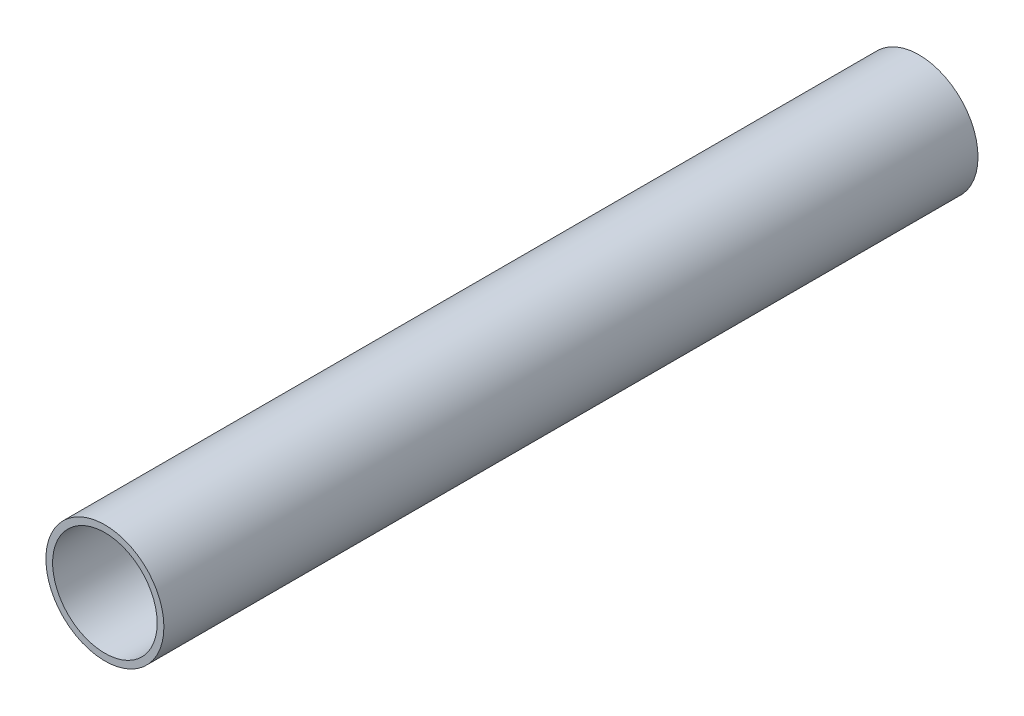
ISO-10303-21;
HEADER;
FILE_DESCRIPTION(('STEP AP214'),'2;1');
FILE_NAME('part.step','',(''),(''),'','','');
FILE_SCHEMA(('AUTOMOTIVE_DESIGN { 1 0 10303 214 1 1 1 1 }'));
ENDSEC;
DATA;
#1=APPLICATION_CONTEXT('core data for automotive mechanical design processes');
#2=APPLICATION_PROTOCOL_DEFINITION('international standard','automotive_design',2000,#1);
#3=PRODUCT_CONTEXT('',#1,'mechanical');
#4=PRODUCT('Part','Part','',(#3));
#5=PRODUCT_RELATED_PRODUCT_CATEGORY('part','',(#4));
#6=PRODUCT_DEFINITION_FORMATION('','',#4);
#7=PRODUCT_DEFINITION_CONTEXT('part definition',#1,'design');
#8=PRODUCT_DEFINITION('design','',#6,#7);
#9=PRODUCT_DEFINITION_SHAPE('','',#8);
#10=(LENGTH_UNIT() NAMED_UNIT(*) SI_UNIT(.MILLI.,.METRE.));
#11=(NAMED_UNIT(*) PLANE_ANGLE_UNIT() SI_UNIT($,.RADIAN.));
#12=(NAMED_UNIT(*) SI_UNIT($,.STERADIAN.) SOLID_ANGLE_UNIT());
#13=UNCERTAINTY_MEASURE_WITH_UNIT(LENGTH_MEASURE(1.E-05),#10,'distance_accuracy_value','');
#14=(GEOMETRIC_REPRESENTATION_CONTEXT(3) GLOBAL_UNCERTAINTY_ASSIGNED_CONTEXT((#13)) GLOBAL_UNIT_ASSIGNED_CONTEXT((#10,
#11,#12)) REPRESENTATION_CONTEXT('',''));
#15=CARTESIAN_POINT('',(0.,0.,0.));
#16=DIRECTION('',(0.,0.,1.));
#17=DIRECTION('',(1.,0.,0.));
#18=AXIS2_PLACEMENT_3D('',#15,#16,#17);
#19=CARTESIAN_POINT('',(0.,0.,242.));
#20=DIRECTION('',(0.,0.,1.));
#21=DIRECTION('',(1.,0.,0.));
#22=AXIS2_PLACEMENT_3D('',#19,#20,#21);
#23=PLANE('',#22);
#24=CARTESIAN_POINT('',(0.,0.,242.));
#25=DIRECTION('',(0.,0.,1.));
#26=DIRECTION('',(1.,0.,0.));
#27=AXIS2_PLACEMENT_3D('',#24,#25,#26);
#28=CIRCLE('',#27,17.54);
#29=CARTESIAN_POINT('',(17.54,0.,242.));
#30=VERTEX_POINT('',#29);
#31=EDGE_CURVE('E10',#30,#30,#28,.T.);
#32=ORIENTED_EDGE('',*,*,#31,.T.);
#33=EDGE_LOOP('',(#32));
#34=FACE_BOUND('',#33,.T.);
#35=CARTESIAN_POINT('',(0.,0.,242.));
#36=DIRECTION('',(0.,0.,1.));
#37=DIRECTION('',(1.,0.,0.));
#38=AXIS2_PLACEMENT_3D('',#35,#36,#37);
#39=CIRCLE('',#38,15.54);
#40=CARTESIAN_POINT('',(15.54,0.,242.));
#41=VERTEX_POINT('',#40);
#42=EDGE_CURVE('E62',#41,#41,#39,.T.);
#43=ORIENTED_EDGE('',*,*,#42,.F.);
#44=EDGE_LOOP('',(#43));
#45=FACE_BOUND('',#44,.T.);
#46=ADVANCED_FACE('F47',(#34,#45),#23,.T.);
#47=CARTESIAN_POINT('',(0.,0.,0.));
#48=DIRECTION('',(0.,0.,1.));
#49=DIRECTION('',(1.,0.,0.));
#50=AXIS2_PLACEMENT_3D('',#47,#48,#49);
#51=PLANE('',#50);
#52=CARTESIAN_POINT('',(0.,0.,0.));
#53=DIRECTION('',(0.,0.,1.));
#54=DIRECTION('',(1.,0.,0.));
#55=AXIS2_PLACEMENT_3D('',#52,#53,#54);
#56=CIRCLE('',#55,17.54);
#57=CARTESIAN_POINT('',(17.54,0.,0.));
#58=VERTEX_POINT('',#57);
#59=EDGE_CURVE('E51',#58,#58,#56,.T.);
#60=ORIENTED_EDGE('',*,*,#59,.F.);
#61=EDGE_LOOP('',(#60));
#62=FACE_BOUND('',#61,.T.);
#63=CARTESIAN_POINT('',(0.,0.,0.));
#64=DIRECTION('',(0.,0.,1.));
#65=DIRECTION('',(1.,0.,0.));
#66=AXIS2_PLACEMENT_3D('',#63,#64,#65);
#67=CIRCLE('',#66,15.54);
#68=CARTESIAN_POINT('',(15.54,0.,0.));
#69=VERTEX_POINT('',#68);
#70=EDGE_CURVE('E64',#69,#69,#67,.T.);
#71=ORIENTED_EDGE('',*,*,#70,.T.);
#72=EDGE_LOOP('',(#71));
#73=FACE_BOUND('',#72,.T.);
#74=ADVANCED_FACE('F76',(#62,#73),#51,.F.);
#75=CARTESIAN_POINT('',(0.,0.,242.));
#76=DIRECTION('',(0.,0.,-1.));
#77=DIRECTION('',(-1.,0.,0.));
#78=AXIS2_PLACEMENT_3D('',#75,#76,#77);
#79=CYLINDRICAL_SURFACE('',#78,17.54);
#80=ORIENTED_EDGE('',*,*,#31,.F.);
#81=EDGE_LOOP('',(#80));
#82=FACE_BOUND('',#81,.T.);
#83=ORIENTED_EDGE('',*,*,#59,.T.);
#84=EDGE_LOOP('',(#83));
#85=FACE_BOUND('',#84,.T.);
#86=ADVANCED_FACE('F49',(#82,#85),#79,.T.);
#87=CARTESIAN_POINT('',(0.,0.,242.));
#88=DIRECTION('',(0.,0.,-1.));
#89=DIRECTION('',(-1.,0.,0.));
#90=AXIS2_PLACEMENT_3D('',#87,#88,#89);
#91=CYLINDRICAL_SURFACE('',#90,15.54);
#92=ORIENTED_EDGE('',*,*,#42,.T.);
#93=EDGE_LOOP('',(#92));
#94=FACE_BOUND('',#93,.T.);
#95=ORIENTED_EDGE('',*,*,#70,.F.);
#96=EDGE_LOOP('',(#95));
#97=FACE_BOUND('',#96,.T.);
#98=ADVANCED_FACE('F72',(#94,#97),#91,.F.);
#99=CLOSED_SHELL('',(#46,#74,#86,#98));
#100=MANIFOLD_SOLID_BREP('B2',#99);
#101=ADVANCED_BREP_SHAPE_REPRESENTATION('',(#18,#100),#14);
#102=SHAPE_DEFINITION_REPRESENTATION(#9,#101);
ENDSEC;
END-ISO-10303-21;
